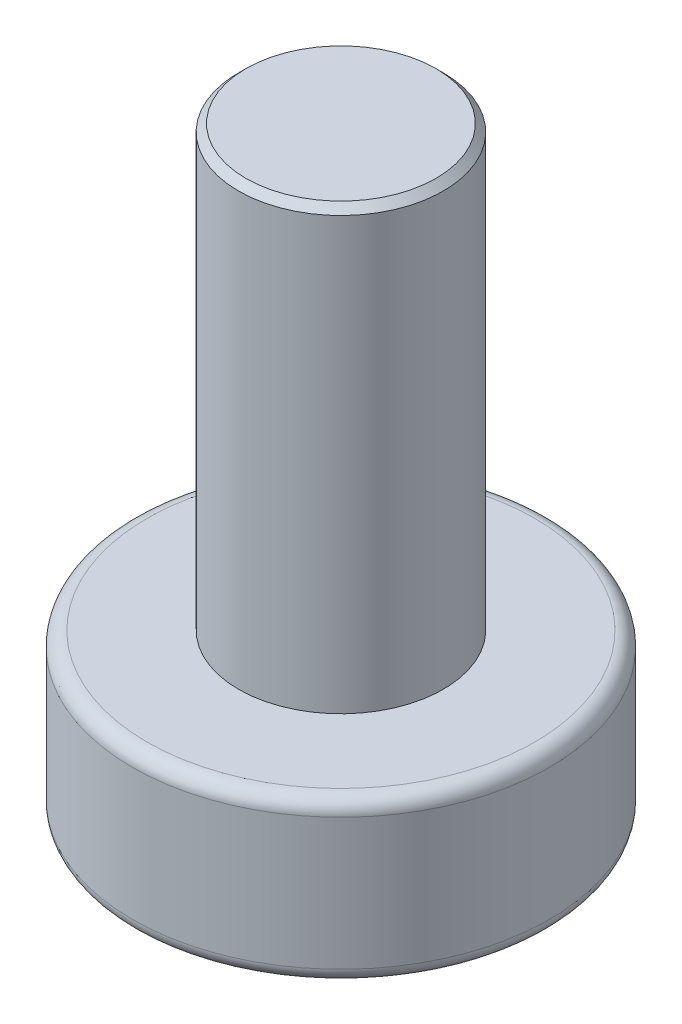
ISO-10303-21;
HEADER;
FILE_DESCRIPTION(('STEP AP214'),'2;1');
FILE_NAME('part.step','',(''),(''),'','','');
FILE_SCHEMA(('AUTOMOTIVE_DESIGN { 1 0 10303 214 1 1 1 1 }'));
ENDSEC;
DATA;
#1=APPLICATION_CONTEXT('core data for automotive mechanical design processes');
#2=APPLICATION_PROTOCOL_DEFINITION('international standard','automotive_design',2000,#1);
#3=PRODUCT_CONTEXT('',#1,'mechanical');
#4=PRODUCT('Part','Part','',(#3));
#5=PRODUCT_RELATED_PRODUCT_CATEGORY('part','',(#4));
#6=PRODUCT_DEFINITION_FORMATION('','',#4);
#7=PRODUCT_DEFINITION_CONTEXT('part definition',#1,'design');
#8=PRODUCT_DEFINITION('design','',#6,#7);
#9=PRODUCT_DEFINITION_SHAPE('','',#8);
#10=(LENGTH_UNIT() NAMED_UNIT(*) SI_UNIT(.MILLI.,.METRE.));
#11=(NAMED_UNIT(*) PLANE_ANGLE_UNIT() SI_UNIT($,.RADIAN.));
#12=(NAMED_UNIT(*) SI_UNIT($,.STERADIAN.) SOLID_ANGLE_UNIT());
#13=UNCERTAINTY_MEASURE_WITH_UNIT(LENGTH_MEASURE(1.E-05),#10,'distance_accuracy_value','');
#14=(GEOMETRIC_REPRESENTATION_CONTEXT(3) GLOBAL_UNCERTAINTY_ASSIGNED_CONTEXT((#13)) GLOBAL_UNIT_ASSIGNED_CONTEXT((#10,
#11,#12)) REPRESENTATION_CONTEXT('',''));
#15=CARTESIAN_POINT('',(0.,0.,0.));
#16=DIRECTION('',(0.,0.,1.));
#17=DIRECTION('',(1.,0.,0.));
#18=AXIS2_PLACEMENT_3D('',#15,#16,#17);
#19=CARTESIAN_POINT('',(0.,2.2,0.));
#20=DIRECTION('',(0.,-1.,0.));
#21=DIRECTION('',(0.,0.,-1.));
#22=AXIS2_PLACEMENT_3D('',#19,#20,#21);
#23=CYLINDRICAL_SURFACE('',#22,2.85);
#24=CARTESIAN_POINT('',(0.,2.,0.));
#25=DIRECTION('',(0.,1.,0.));
#26=DIRECTION('',(0.,0.,1.));
#27=AXIS2_PLACEMENT_3D('',#24,#25,#26);
#28=CIRCLE('',#27,2.85);
#29=CARTESIAN_POINT('',(0.,2.,2.85));
#30=VERTEX_POINT('',#29);
#31=EDGE_CURVE('E43',#30,#30,#28,.F.);
#32=ORIENTED_EDGE('',*,*,#31,.T.);
#33=EDGE_LOOP('',(#32));
#34=FACE_BOUND('',#33,.T.);
#35=CARTESIAN_POINT('',(0.,0.2,0.));
#36=DIRECTION('',(0.,1.,0.));
#37=DIRECTION('',(0.,0.,1.));
#38=AXIS2_PLACEMENT_3D('',#35,#36,#37);
#39=CIRCLE('',#38,2.85);
#40=CARTESIAN_POINT('',(0.,0.2,2.85));
#41=VERTEX_POINT('',#40);
#42=EDGE_CURVE('E220',#41,#41,#39,.T.);
#43=ORIENTED_EDGE('',*,*,#42,.T.);
#44=EDGE_LOOP('',(#43));
#45=FACE_BOUND('',#44,.T.);
#46=ADVANCED_FACE('F35',(#34,#45),#23,.T.);
#47=CARTESIAN_POINT('',(0.,2.2,0.));
#48=DIRECTION('',(0.,1.,0.));
#49=DIRECTION('',(0.,0.,1.));
#50=AXIS2_PLACEMENT_3D('',#47,#48,#49);
#51=PLANE('',#50);
#52=CARTESIAN_POINT('',(0.,2.2,0.));
#53=DIRECTION('',(0.,1.,0.));
#54=DIRECTION('',(0.,0.,1.));
#55=AXIS2_PLACEMENT_3D('',#52,#53,#54);
#56=CIRCLE('',#55,2.65);
#57=CARTESIAN_POINT('',(0.,2.2,2.65));
#58=VERTEX_POINT('',#57);
#59=EDGE_CURVE('E217',#58,#58,#56,.T.);
#60=ORIENTED_EDGE('',*,*,#59,.T.);
#61=EDGE_LOOP('',(#60));
#62=FACE_BOUND('',#61,.T.);
#63=CARTESIAN_POINT('',(0.,2.2,0.));
#64=DIRECTION('',(0.,1.,0.));
#65=DIRECTION('',(0.,0.,1.));
#66=AXIS2_PLACEMENT_3D('',#63,#64,#65);
#67=CIRCLE('',#66,1.4);
#68=CARTESIAN_POINT('',(0.,2.2,1.4));
#69=VERTEX_POINT('',#68);
#70=EDGE_CURVE('E191',#69,#69,#67,.T.);
#71=ORIENTED_EDGE('',*,*,#70,.F.);
#72=EDGE_LOOP('',(#71));
#73=FACE_BOUND('',#72,.T.);
#74=ADVANCED_FACE('F233',(#62,#73),#51,.T.);
#75=CARTESIAN_POINT('',(0.,0.,0.));
#76=DIRECTION('',(0.,1.,0.));
#77=DIRECTION('',(0.,0.,1.));
#78=AXIS2_PLACEMENT_3D('',#75,#76,#77);
#79=PLANE('',#78);
#80=DIRECTION('',(0.,0.,-1.));
#81=VECTOR('',#80,1.);
#82=CARTESIAN_POINT('',(-2.,0.,-0.5));
#83=LINE('',#82,#81);
#84=CARTESIAN_POINT('',(-2.,0.,0.5));
#85=VERTEX_POINT('',#84);
#86=CARTESIAN_POINT('',(-2.,0.,-0.5));
#87=VERTEX_POINT('',#86);
#88=EDGE_CURVE('E160',#85,#87,#83,.T.);
#89=ORIENTED_EDGE('',*,*,#88,.F.);
#90=DIRECTION('',(-1.,0.,0.));
#91=VECTOR('',#90,1.);
#92=CARTESIAN_POINT('',(-2.,0.,0.5));
#93=LINE('',#92,#91);
#94=CARTESIAN_POINT('',(-0.5,0.,0.5));
#95=VERTEX_POINT('',#94);
#96=EDGE_CURVE('E50',#95,#85,#93,.T.);
#97=ORIENTED_EDGE('',*,*,#96,.F.);
#98=DIRECTION('',(0.,0.,-1.));
#99=VECTOR('',#98,1.);
#100=CARTESIAN_POINT('',(-0.5,0.,0.5));
#101=LINE('',#100,#99);
#102=CARTESIAN_POINT('',(-0.5,0.,2.));
#103=VERTEX_POINT('',#102);
#104=EDGE_CURVE('E187',#103,#95,#101,.T.);
#105=ORIENTED_EDGE('',*,*,#104,.F.);
#106=DIRECTION('',(-1.,0.,0.));
#107=VECTOR('',#106,1.);
#108=CARTESIAN_POINT('',(-0.5,0.,2.));
#109=LINE('',#108,#107);
#110=CARTESIAN_POINT('',(0.5,0.,2.));
#111=VERTEX_POINT('',#110);
#112=EDGE_CURVE('E185',#111,#103,#109,.T.);
#113=ORIENTED_EDGE('',*,*,#112,.F.);
#114=DIRECTION('',(0.,0.,1.));
#115=VECTOR('',#114,1.);
#116=CARTESIAN_POINT('',(0.5,0.,2.));
#117=LINE('',#116,#115);
#118=CARTESIAN_POINT('',(0.5,0.,0.5));
#119=VERTEX_POINT('',#118);
#120=EDGE_CURVE('E134',#119,#111,#117,.T.);
#121=ORIENTED_EDGE('',*,*,#120,.F.);
#122=DIRECTION('',(-1.,0.,0.));
#123=VECTOR('',#122,1.);
#124=CARTESIAN_POINT('',(0.5,0.,0.5));
#125=LINE('',#124,#123);
#126=CARTESIAN_POINT('',(2.,0.,0.5));
#127=VERTEX_POINT('',#126);
#128=EDGE_CURVE('E181',#127,#119,#125,.T.);
#129=ORIENTED_EDGE('',*,*,#128,.F.);
#130=DIRECTION('',(0.,0.,1.));
#131=VECTOR('',#130,1.);
#132=CARTESIAN_POINT('',(2.,0.,0.5));
#133=LINE('',#132,#131);
#134=CARTESIAN_POINT('',(2.,0.,-0.5));
#135=VERTEX_POINT('',#134);
#136=EDGE_CURVE('E178',#135,#127,#133,.T.);
#137=ORIENTED_EDGE('',*,*,#136,.F.);
#138=DIRECTION('',(1.,0.,0.));
#139=VECTOR('',#138,1.);
#140=CARTESIAN_POINT('',(2.,0.,-0.5));
#141=LINE('',#140,#139);
#142=CARTESIAN_POINT('',(0.5,0.,-0.5));
#143=VERTEX_POINT('',#142);
#144=EDGE_CURVE('E175',#143,#135,#141,.T.);
#145=ORIENTED_EDGE('',*,*,#144,.F.);
#146=DIRECTION('',(0.,0.,1.));
#147=VECTOR('',#146,1.);
#148=CARTESIAN_POINT('',(0.5,0.,-0.5));
#149=LINE('',#148,#147);
#150=CARTESIAN_POINT('',(0.5,0.,-2.));
#151=VERTEX_POINT('',#150);
#152=EDGE_CURVE('E172',#151,#143,#149,.T.);
#153=ORIENTED_EDGE('',*,*,#152,.F.);
#154=DIRECTION('',(1.,0.,0.));
#155=VECTOR('',#154,1.);
#156=CARTESIAN_POINT('',(0.5,0.,-2.));
#157=LINE('',#156,#155);
#158=CARTESIAN_POINT('',(-0.5,0.,-2.));
#159=VERTEX_POINT('',#158);
#160=EDGE_CURVE('E169',#159,#151,#157,.T.);
#161=ORIENTED_EDGE('',*,*,#160,.F.);
#162=DIRECTION('',(0.,0.,-1.));
#163=VECTOR('',#162,1.);
#164=CARTESIAN_POINT('',(-0.5,0.,-2.));
#165=LINE('',#164,#163);
#166=CARTESIAN_POINT('',(-0.5,0.,-0.5));
#167=VERTEX_POINT('',#166);
#168=EDGE_CURVE('E166',#167,#159,#165,.T.);
#169=ORIENTED_EDGE('',*,*,#168,.F.);
#170=DIRECTION('',(1.,0.,0.));
#171=VECTOR('',#170,1.);
#172=CARTESIAN_POINT('',(-0.5,0.,-0.5));
#173=LINE('',#172,#171);
#174=EDGE_CURVE('E163',#87,#167,#173,.T.);
#175=ORIENTED_EDGE('',*,*,#174,.F.);
#176=EDGE_LOOP('',(#89,#97,#105,#113,#121,#129,#137,#145,#153,#161,#169,#175));
#177=FACE_BOUND('',#176,.T.);
#178=CARTESIAN_POINT('',(0.,0.,0.));
#179=DIRECTION('',(0.,1.,0.));
#180=DIRECTION('',(0.,0.,1.));
#181=AXIS2_PLACEMENT_3D('',#178,#179,#180);
#182=CIRCLE('',#181,2.65);
#183=CARTESIAN_POINT('',(0.,0.,2.65));
#184=VERTEX_POINT('',#183);
#185=EDGE_CURVE('E11',#184,#184,#182,.F.);
#186=ORIENTED_EDGE('',*,*,#185,.T.);
#187=EDGE_LOOP('',(#186));
#188=FACE_BOUND('',#187,.T.);
#189=ADVANCED_FACE('F236',(#177,#188),#79,.F.);
#190=CARTESIAN_POINT('',(0.,8.2,0.));
#191=DIRECTION('',(0.,-1.,0.));
#192=DIRECTION('',(0.,0.,-1.));
#193=AXIS2_PLACEMENT_3D('',#190,#191,#192);
#194=CYLINDRICAL_SURFACE('',#193,1.4);
#195=CARTESIAN_POINT('',(0.,8.1,0.));
#196=DIRECTION('',(0.,1.,0.));
#197=DIRECTION('',(0.,0.,1.));
#198=AXIS2_PLACEMENT_3D('',#195,#196,#197);
#199=CIRCLE('',#198,1.4);
#200=CARTESIAN_POINT('',(0.,8.1,1.4));
#201=VERTEX_POINT('',#200);
#202=EDGE_CURVE('E214',#201,#201,#199,.F.);
#203=ORIENTED_EDGE('',*,*,#202,.T.);
#204=EDGE_LOOP('',(#203));
#205=FACE_BOUND('',#204,.T.);
#206=ORIENTED_EDGE('',*,*,#70,.T.);
#207=EDGE_LOOP('',(#206));
#208=FACE_BOUND('',#207,.T.);
#209=ADVANCED_FACE('F240',(#205,#208),#194,.T.);
#210=CARTESIAN_POINT('',(0.,8.2,0.));
#211=DIRECTION('',(0.,1.,0.));
#212=DIRECTION('',(0.,0.,1.));
#213=AXIS2_PLACEMENT_3D('',#210,#211,#212);
#214=PLANE('',#213);
#215=CARTESIAN_POINT('',(0.,8.2,0.));
#216=DIRECTION('',(0.,1.,0.));
#217=DIRECTION('',(0.,0.,1.));
#218=AXIS2_PLACEMENT_3D('',#215,#216,#217);
#219=CIRCLE('',#218,1.3);
#220=CARTESIAN_POINT('',(0.,8.2,1.3));
#221=VERTEX_POINT('',#220);
#222=EDGE_CURVE('E211',#221,#221,#219,.T.);
#223=ORIENTED_EDGE('',*,*,#222,.T.);
#224=EDGE_LOOP('',(#223));
#225=FACE_BOUND('',#224,.T.);
#226=ADVANCED_FACE('F242',(#225),#214,.T.);
#227=CARTESIAN_POINT('',(0.,8.2,0.));
#228=DIRECTION('',(0.,-1.,0.));
#229=DIRECTION('',(0.,0.,-1.));
#230=AXIS2_PLACEMENT_3D('',#227,#228,#229);
#231=CONICAL_SURFACE('',#230,1.3,0.785398163397448);
#232=ORIENTED_EDGE('',*,*,#202,.F.);
#233=EDGE_LOOP('',(#232));
#234=FACE_BOUND('',#233,.T.);
#235=ORIENTED_EDGE('',*,*,#222,.F.);
#236=EDGE_LOOP('',(#235));
#237=FACE_BOUND('',#236,.T.);
#238=ADVANCED_FACE('F230',(#234,#237),#231,.T.);
#239=CARTESIAN_POINT('',(0.,2.,0.));
#240=DIRECTION('',(0.,1.,0.));
#241=DIRECTION('',(0.,0.,1.));
#242=AXIS2_PLACEMENT_3D('',#239,#240,#241);
#243=TOROIDAL_SURFACE('',#242,2.65,0.2);
#244=ORIENTED_EDGE('',*,*,#31,.F.);
#245=EDGE_LOOP('',(#244));
#246=FACE_BOUND('',#245,.T.);
#247=ORIENTED_EDGE('',*,*,#59,.F.);
#248=EDGE_LOOP('',(#247));
#249=FACE_BOUND('',#248,.T.);
#250=ADVANCED_FACE('F227',(#246,#249),#243,.T.);
#251=CARTESIAN_POINT('',(0.,0.2,0.));
#252=DIRECTION('',(0.,1.,0.));
#253=DIRECTION('',(0.,0.,1.));
#254=AXIS2_PLACEMENT_3D('',#251,#252,#253);
#255=TOROIDAL_SURFACE('',#254,2.65,0.2);
#256=ORIENTED_EDGE('',*,*,#185,.F.);
#257=EDGE_LOOP('',(#256));
#258=FACE_BOUND('',#257,.T.);
#259=ORIENTED_EDGE('',*,*,#42,.F.);
#260=EDGE_LOOP('',(#259));
#261=FACE_BOUND('',#260,.T.);
#262=ADVANCED_FACE('F37',(#258,#261),#255,.T.);
#263=CARTESIAN_POINT('',(-2.,1.5,0.5));
#264=DIRECTION('',(0.,0.,1.));
#265=DIRECTION('',(1.,0.,0.));
#266=AXIS2_PLACEMENT_3D('',#263,#264,#265);
#267=PLANE('',#266);
#268=ORIENTED_EDGE('',*,*,#96,.T.);
#269=DIRECTION('',(0.,-1.,0.));
#270=VECTOR('',#269,1.);
#271=CARTESIAN_POINT('',(-2.,1.5,0.5));
#272=LINE('',#271,#270);
#273=CARTESIAN_POINT('',(-2.,1.5,0.5));
#274=VERTEX_POINT('',#273);
#275=EDGE_CURVE('E98',#274,#85,#272,.T.);
#276=ORIENTED_EDGE('',*,*,#275,.F.);
#277=DIRECTION('',(-1.,0.,0.));
#278=VECTOR('',#277,1.);
#279=CARTESIAN_POINT('',(-2.,1.5,0.5));
#280=LINE('',#279,#278);
#281=CARTESIAN_POINT('',(-0.5,1.5,0.5));
#282=VERTEX_POINT('',#281);
#283=EDGE_CURVE('E189',#282,#274,#280,.T.);
#284=ORIENTED_EDGE('',*,*,#283,.F.);
#285=DIRECTION('',(0.,-1.,0.));
#286=VECTOR('',#285,1.);
#287=CARTESIAN_POINT('',(-0.5,1.5,0.5));
#288=LINE('',#287,#286);
#289=EDGE_CURVE('E58',#282,#95,#288,.T.);
#290=ORIENTED_EDGE('',*,*,#289,.T.);
#291=EDGE_LOOP('',(#268,#276,#284,#290));
#292=FACE_BOUND('',#291,.T.);
#293=ADVANCED_FACE('F278',(#292),#267,.F.);
#294=CARTESIAN_POINT('',(-0.5,1.5,0.5));
#295=DIRECTION('',(-1.,0.,0.));
#296=DIRECTION('',(0.,0.,1.));
#297=AXIS2_PLACEMENT_3D('',#294,#295,#296);
#298=PLANE('',#297);
#299=ORIENTED_EDGE('',*,*,#104,.T.);
#300=ORIENTED_EDGE('',*,*,#289,.F.);
#301=DIRECTION('',(0.,0.,-1.));
#302=VECTOR('',#301,1.);
#303=CARTESIAN_POINT('',(-0.5,1.5,0.5));
#304=LINE('',#303,#302);
#305=CARTESIAN_POINT('',(-0.5,1.5,2.));
#306=VERTEX_POINT('',#305);
#307=EDGE_CURVE('E146',#306,#282,#304,.T.);
#308=ORIENTED_EDGE('',*,*,#307,.F.);
#309=DIRECTION('',(0.,-1.,0.));
#310=VECTOR('',#309,1.);
#311=CARTESIAN_POINT('',(-0.5,1.5,2.));
#312=LINE('',#311,#310);
#313=EDGE_CURVE('E138',#306,#103,#312,.T.);
#314=ORIENTED_EDGE('',*,*,#313,.T.);
#315=EDGE_LOOP('',(#299,#300,#308,#314));
#316=FACE_BOUND('',#315,.T.);
#317=ADVANCED_FACE('F286',(#316),#298,.F.);
#318=CARTESIAN_POINT('',(-0.5,1.5,2.));
#319=DIRECTION('',(0.,0.,1.));
#320=DIRECTION('',(1.,0.,0.));
#321=AXIS2_PLACEMENT_3D('',#318,#319,#320);
#322=PLANE('',#321);
#323=ORIENTED_EDGE('',*,*,#112,.T.);
#324=ORIENTED_EDGE('',*,*,#313,.F.);
#325=DIRECTION('',(-1.,0.,0.));
#326=VECTOR('',#325,1.);
#327=CARTESIAN_POINT('',(-0.5,1.5,2.));
#328=LINE('',#327,#326);
#329=CARTESIAN_POINT('',(0.5,1.5,2.));
#330=VERTEX_POINT('',#329);
#331=EDGE_CURVE('E142',#330,#306,#328,.T.);
#332=ORIENTED_EDGE('',*,*,#331,.F.);
#333=DIRECTION('',(0.,-1.,0.));
#334=VECTOR('',#333,1.);
#335=CARTESIAN_POINT('',(0.5,1.5,2.));
#336=LINE('',#335,#334);
#337=EDGE_CURVE('E127',#330,#111,#336,.T.);
#338=ORIENTED_EDGE('',*,*,#337,.T.);
#339=EDGE_LOOP('',(#323,#324,#332,#338));
#340=FACE_BOUND('',#339,.T.);
#341=ADVANCED_FACE('F143',(#340),#322,.F.);
#342=CARTESIAN_POINT('',(0.5,1.5,2.));
#343=DIRECTION('',(1.,0.,0.));
#344=DIRECTION('',(0.,0.,-1.));
#345=AXIS2_PLACEMENT_3D('',#342,#343,#344);
#346=PLANE('',#345);
#347=ORIENTED_EDGE('',*,*,#120,.T.);
#348=ORIENTED_EDGE('',*,*,#337,.F.);
#349=DIRECTION('',(0.,0.,1.));
#350=VECTOR('',#349,1.);
#351=CARTESIAN_POINT('',(0.5,1.5,2.));
#352=LINE('',#351,#350);
#353=CARTESIAN_POINT('',(0.5,1.5,0.5));
#354=VERTEX_POINT('',#353);
#355=EDGE_CURVE('E131',#354,#330,#352,.T.);
#356=ORIENTED_EDGE('',*,*,#355,.F.);
#357=DIRECTION('',(0.,-1.,0.));
#358=VECTOR('',#357,1.);
#359=CARTESIAN_POINT('',(0.5,1.5,0.5));
#360=LINE('',#359,#358);
#361=EDGE_CURVE('E139',#354,#119,#360,.T.);
#362=ORIENTED_EDGE('',*,*,#361,.T.);
#363=EDGE_LOOP('',(#347,#348,#356,#362));
#364=FACE_BOUND('',#363,.T.);
#365=ADVANCED_FACE('F129',(#364),#346,.F.);
#366=CARTESIAN_POINT('',(0.5,1.5,0.5));
#367=DIRECTION('',(0.,0.,1.));
#368=DIRECTION('',(1.,0.,0.));
#369=AXIS2_PLACEMENT_3D('',#366,#367,#368);
#370=PLANE('',#369);
#371=ORIENTED_EDGE('',*,*,#128,.T.);
#372=ORIENTED_EDGE('',*,*,#361,.F.);
#373=DIRECTION('',(-1.,0.,0.));
#374=VECTOR('',#373,1.);
#375=CARTESIAN_POINT('',(0.5,1.5,0.5));
#376=LINE('',#375,#374);
#377=CARTESIAN_POINT('',(2.,1.5,0.5));
#378=VERTEX_POINT('',#377);
#379=EDGE_CURVE('E152',#378,#354,#376,.T.);
#380=ORIENTED_EDGE('',*,*,#379,.F.);
#381=DIRECTION('',(0.,-1.,0.));
#382=VECTOR('',#381,1.);
#383=CARTESIAN_POINT('',(2.,1.5,0.5));
#384=LINE('',#383,#382);
#385=EDGE_CURVE('E194',#378,#127,#384,.T.);
#386=ORIENTED_EDGE('',*,*,#385,.T.);
#387=EDGE_LOOP('',(#371,#372,#380,#386));
#388=FACE_BOUND('',#387,.T.);
#389=ADVANCED_FACE('F305',(#388),#370,.F.);
#390=CARTESIAN_POINT('',(2.,1.5,0.5));
#391=DIRECTION('',(1.,0.,0.));
#392=DIRECTION('',(0.,0.,-1.));
#393=AXIS2_PLACEMENT_3D('',#390,#391,#392);
#394=PLANE('',#393);
#395=ORIENTED_EDGE('',*,*,#136,.T.);
#396=ORIENTED_EDGE('',*,*,#385,.F.);
#397=DIRECTION('',(0.,0.,1.));
#398=VECTOR('',#397,1.);
#399=CARTESIAN_POINT('',(2.,1.5,0.5));
#400=LINE('',#399,#398);
#401=CARTESIAN_POINT('',(2.,1.5,-0.5));
#402=VERTEX_POINT('',#401);
#403=EDGE_CURVE('E154',#402,#378,#400,.T.);
#404=ORIENTED_EDGE('',*,*,#403,.F.);
#405=DIRECTION('',(0.,-1.,0.));
#406=VECTOR('',#405,1.);
#407=CARTESIAN_POINT('',(2.,1.5,-0.5));
#408=LINE('',#407,#406);
#409=EDGE_CURVE('E196',#402,#135,#408,.T.);
#410=ORIENTED_EDGE('',*,*,#409,.T.);
#411=EDGE_LOOP('',(#395,#396,#404,#410));
#412=FACE_BOUND('',#411,.T.);
#413=ADVANCED_FACE('F312',(#412),#394,.F.);
#414=CARTESIAN_POINT('',(2.,1.5,-0.5));
#415=DIRECTION('',(0.,0.,-1.));
#416=DIRECTION('',(-1.,0.,0.));
#417=AXIS2_PLACEMENT_3D('',#414,#415,#416);
#418=PLANE('',#417);
#419=ORIENTED_EDGE('',*,*,#144,.T.);
#420=ORIENTED_EDGE('',*,*,#409,.F.);
#421=DIRECTION('',(1.,0.,0.));
#422=VECTOR('',#421,1.);
#423=CARTESIAN_POINT('',(2.,1.5,-0.5));
#424=LINE('',#423,#422);
#425=CARTESIAN_POINT('',(0.5,1.5,-0.5));
#426=VERTEX_POINT('',#425);
#427=EDGE_CURVE('E455',#426,#402,#424,.T.);
#428=ORIENTED_EDGE('',*,*,#427,.F.);
#429=DIRECTION('',(0.,-1.,0.));
#430=VECTOR('',#429,1.);
#431=CARTESIAN_POINT('',(0.5,1.5,-0.5));
#432=LINE('',#431,#430);
#433=EDGE_CURVE('E198',#426,#143,#432,.T.);
#434=ORIENTED_EDGE('',*,*,#433,.T.);
#435=EDGE_LOOP('',(#419,#420,#428,#434));
#436=FACE_BOUND('',#435,.T.);
#437=ADVANCED_FACE('F320',(#436),#418,.F.);
#438=CARTESIAN_POINT('',(0.5,1.5,-0.5));
#439=DIRECTION('',(1.,0.,0.));
#440=DIRECTION('',(0.,0.,-1.));
#441=AXIS2_PLACEMENT_3D('',#438,#439,#440);
#442=PLANE('',#441);
#443=ORIENTED_EDGE('',*,*,#152,.T.);
#444=ORIENTED_EDGE('',*,*,#433,.F.);
#445=DIRECTION('',(0.,0.,1.));
#446=VECTOR('',#445,1.);
#447=CARTESIAN_POINT('',(0.5,1.5,-0.5));
#448=LINE('',#447,#446);
#449=CARTESIAN_POINT('',(0.5,1.5,-2.));
#450=VERTEX_POINT('',#449);
#451=EDGE_CURVE('E452',#450,#426,#448,.T.);
#452=ORIENTED_EDGE('',*,*,#451,.F.);
#453=DIRECTION('',(0.,-1.,0.));
#454=VECTOR('',#453,1.);
#455=CARTESIAN_POINT('',(0.5,1.5,-2.));
#456=LINE('',#455,#454);
#457=EDGE_CURVE('E200',#450,#151,#456,.T.);
#458=ORIENTED_EDGE('',*,*,#457,.T.);
#459=EDGE_LOOP('',(#443,#444,#452,#458));
#460=FACE_BOUND('',#459,.T.);
#461=ADVANCED_FACE('F328',(#460),#442,.F.);
#462=CARTESIAN_POINT('',(0.5,1.5,-2.));
#463=DIRECTION('',(0.,0.,-1.));
#464=DIRECTION('',(-1.,0.,0.));
#465=AXIS2_PLACEMENT_3D('',#462,#463,#464);
#466=PLANE('',#465);
#467=ORIENTED_EDGE('',*,*,#160,.T.);
#468=ORIENTED_EDGE('',*,*,#457,.F.);
#469=DIRECTION('',(1.,0.,0.));
#470=VECTOR('',#469,1.);
#471=CARTESIAN_POINT('',(0.5,1.5,-2.));
#472=LINE('',#471,#470);
#473=CARTESIAN_POINT('',(-0.5,1.5,-2.));
#474=VERTEX_POINT('',#473);
#475=EDGE_CURVE('E449',#474,#450,#472,.T.);
#476=ORIENTED_EDGE('',*,*,#475,.F.);
#477=DIRECTION('',(0.,-1.,0.));
#478=VECTOR('',#477,1.);
#479=CARTESIAN_POINT('',(-0.5,1.5,-2.));
#480=LINE('',#479,#478);
#481=EDGE_CURVE('E202',#474,#159,#480,.T.);
#482=ORIENTED_EDGE('',*,*,#481,.T.);
#483=EDGE_LOOP('',(#467,#468,#476,#482));
#484=FACE_BOUND('',#483,.T.);
#485=ADVANCED_FACE('F336',(#484),#466,.F.);
#486=CARTESIAN_POINT('',(-0.5,1.5,-2.));
#487=DIRECTION('',(-1.,0.,0.));
#488=DIRECTION('',(0.,0.,1.));
#489=AXIS2_PLACEMENT_3D('',#486,#487,#488);
#490=PLANE('',#489);
#491=ORIENTED_EDGE('',*,*,#168,.T.);
#492=ORIENTED_EDGE('',*,*,#481,.F.);
#493=DIRECTION('',(0.,0.,-1.));
#494=VECTOR('',#493,1.);
#495=CARTESIAN_POINT('',(-0.5,1.5,-2.));
#496=LINE('',#495,#494);
#497=CARTESIAN_POINT('',(-0.5,1.5,-0.5));
#498=VERTEX_POINT('',#497);
#499=EDGE_CURVE('E442',#498,#474,#496,.T.);
#500=ORIENTED_EDGE('',*,*,#499,.F.);
#501=DIRECTION('',(0.,-1.,0.));
#502=VECTOR('',#501,1.);
#503=CARTESIAN_POINT('',(-0.5,1.5,-0.5));
#504=LINE('',#503,#502);
#505=EDGE_CURVE('E204',#498,#167,#504,.T.);
#506=ORIENTED_EDGE('',*,*,#505,.T.);
#507=EDGE_LOOP('',(#491,#492,#500,#506));
#508=FACE_BOUND('',#507,.T.);
#509=ADVANCED_FACE('F344',(#508),#490,.F.);
#510=CARTESIAN_POINT('',(-0.5,1.5,-0.5));
#511=DIRECTION('',(0.,0.,-1.));
#512=DIRECTION('',(-1.,0.,0.));
#513=AXIS2_PLACEMENT_3D('',#510,#511,#512);
#514=PLANE('',#513);
#515=ORIENTED_EDGE('',*,*,#174,.T.);
#516=ORIENTED_EDGE('',*,*,#505,.F.);
#517=DIRECTION('',(1.,0.,0.));
#518=VECTOR('',#517,1.);
#519=CARTESIAN_POINT('',(-0.5,1.5,-0.5));
#520=LINE('',#519,#518);
#521=CARTESIAN_POINT('',(-2.,1.5,-0.5));
#522=VERTEX_POINT('',#521);
#523=EDGE_CURVE('E439',#522,#498,#520,.T.);
#524=ORIENTED_EDGE('',*,*,#523,.F.);
#525=DIRECTION('',(0.,-1.,0.));
#526=VECTOR('',#525,1.);
#527=CARTESIAN_POINT('',(-2.,1.5,-0.5));
#528=LINE('',#527,#526);
#529=EDGE_CURVE('E206',#522,#87,#528,.T.);
#530=ORIENTED_EDGE('',*,*,#529,.T.);
#531=EDGE_LOOP('',(#515,#516,#524,#530));
#532=FACE_BOUND('',#531,.T.);
#533=ADVANCED_FACE('F352',(#532),#514,.F.);
#534=CARTESIAN_POINT('',(-2.,1.5,-0.5));
#535=DIRECTION('',(-1.,0.,0.));
#536=DIRECTION('',(0.,0.,1.));
#537=AXIS2_PLACEMENT_3D('',#534,#535,#536);
#538=PLANE('',#537);
#539=ORIENTED_EDGE('',*,*,#88,.T.);
#540=ORIENTED_EDGE('',*,*,#529,.F.);
#541=DIRECTION('',(0.,0.,-1.));
#542=VECTOR('',#541,1.);
#543=CARTESIAN_POINT('',(-2.,1.5,-0.5));
#544=LINE('',#543,#542);
#545=EDGE_CURVE('E443',#274,#522,#544,.T.);
#546=ORIENTED_EDGE('',*,*,#545,.F.);
#547=ORIENTED_EDGE('',*,*,#275,.T.);
#548=EDGE_LOOP('',(#539,#540,#546,#547));
#549=FACE_BOUND('',#548,.T.);
#550=ADVANCED_FACE('F360',(#549),#538,.F.);
#551=CARTESIAN_POINT('',(0.,1.5,0.));
#552=DIRECTION('',(0.,-1.,0.));
#553=DIRECTION('',(0.,0.,-1.));
#554=AXIS2_PLACEMENT_3D('',#551,#552,#553);
#555=PLANE('',#554);
#556=ORIENTED_EDGE('',*,*,#283,.T.);
#557=ORIENTED_EDGE('',*,*,#545,.T.);
#558=ORIENTED_EDGE('',*,*,#523,.T.);
#559=ORIENTED_EDGE('',*,*,#499,.T.);
#560=ORIENTED_EDGE('',*,*,#475,.T.);
#561=ORIENTED_EDGE('',*,*,#451,.T.);
#562=ORIENTED_EDGE('',*,*,#427,.T.);
#563=ORIENTED_EDGE('',*,*,#403,.T.);
#564=ORIENTED_EDGE('',*,*,#379,.T.);
#565=ORIENTED_EDGE('',*,*,#355,.T.);
#566=ORIENTED_EDGE('',*,*,#331,.T.);
#567=ORIENTED_EDGE('',*,*,#307,.T.);
#568=EDGE_LOOP('',(#556,#557,#558,#559,#560,#561,#562,#563,#564,#565,#566,#567));
#569=FACE_BOUND('',#568,.T.);
#570=ADVANCED_FACE('F149',(#569),#555,.T.);
#571=CLOSED_SHELL('',(#46,#74,#189,#209,#226,#238,#250,#262,#293,#317,#341,#365,#389,#413,#437,
#461,#485,#509,#533,#550,#570));
#572=MANIFOLD_SOLID_BREP('B2',#571);
#573=ADVANCED_BREP_SHAPE_REPRESENTATION('',(#18,#572),#14);
#574=SHAPE_DEFINITION_REPRESENTATION(#9,#573);
ENDSEC;
END-ISO-10303-21;
